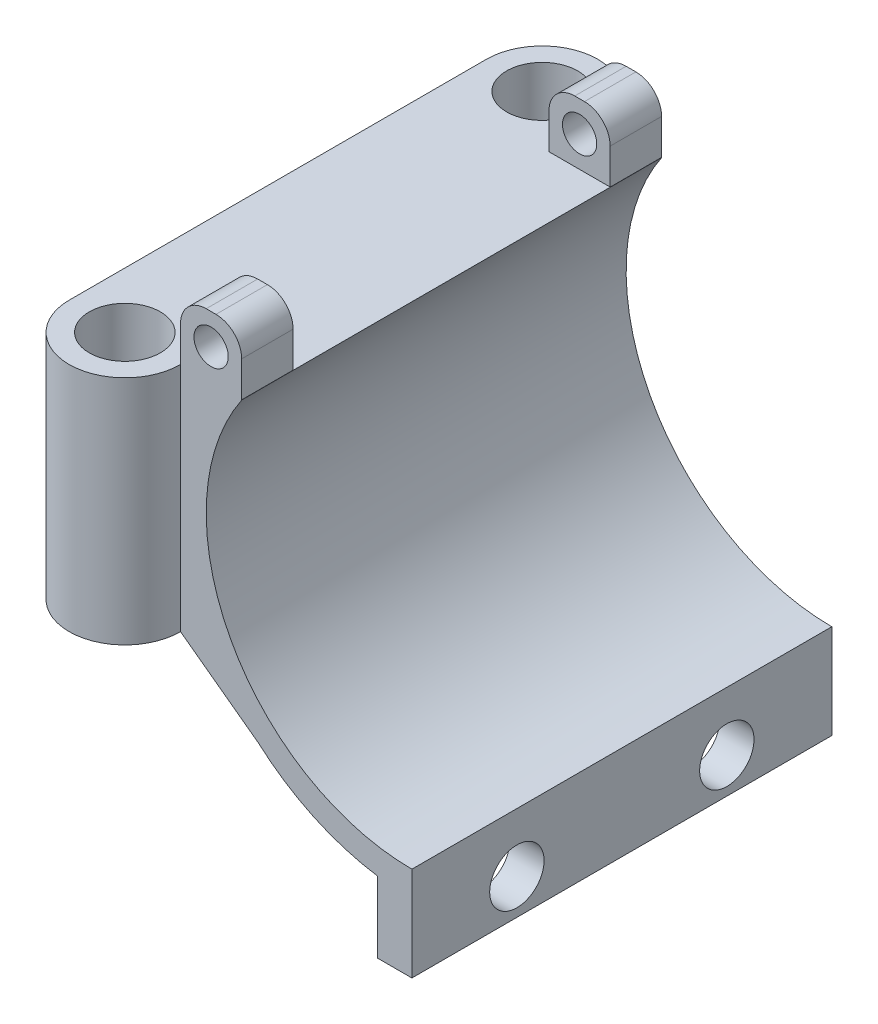
ISO-10303-21;
HEADER;
FILE_DESCRIPTION(('STEP AP214'),'2;1');
FILE_NAME('part.step','',(''),(''),'','','');
FILE_SCHEMA(('AUTOMOTIVE_DESIGN { 1 0 10303 214 1 1 1 1 }'));
ENDSEC;
DATA;
#1=APPLICATION_CONTEXT('core data for automotive mechanical design processes');
#2=APPLICATION_PROTOCOL_DEFINITION('international standard','automotive_design',2000,#1);
#3=PRODUCT_CONTEXT('',#1,'mechanical');
#4=PRODUCT('Part','Part','',(#3));
#5=PRODUCT_RELATED_PRODUCT_CATEGORY('part','',(#4));
#6=PRODUCT_DEFINITION_FORMATION('','',#4);
#7=PRODUCT_DEFINITION_CONTEXT('part definition',#1,'design');
#8=PRODUCT_DEFINITION('design','',#6,#7);
#9=PRODUCT_DEFINITION_SHAPE('','',#8);
#10=(LENGTH_UNIT() NAMED_UNIT(*) SI_UNIT(.MILLI.,.METRE.));
#11=(NAMED_UNIT(*) PLANE_ANGLE_UNIT() SI_UNIT($,.RADIAN.));
#12=(NAMED_UNIT(*) SI_UNIT($,.STERADIAN.) SOLID_ANGLE_UNIT());
#13=UNCERTAINTY_MEASURE_WITH_UNIT(LENGTH_MEASURE(1.E-05),#10,'distance_accuracy_value','');
#14=(GEOMETRIC_REPRESENTATION_CONTEXT(3) GLOBAL_UNCERTAINTY_ASSIGNED_CONTEXT((#13)) GLOBAL_UNIT_ASSIGNED_CONTEXT((#10,
#11,#12)) REPRESENTATION_CONTEXT('',''));
#15=CARTESIAN_POINT('',(0.,0.,0.));
#16=DIRECTION('',(0.,0.,1.));
#17=DIRECTION('',(1.,0.,0.));
#18=AXIS2_PLACEMENT_3D('',#15,#16,#17);
#19=CARTESIAN_POINT('',(6.5,27.,-49.));
#20=DIRECTION('',(-1.,0.,0.));
#21=DIRECTION('',(0.,0.,1.));
#22=AXIS2_PLACEMENT_3D('',#19,#20,#21);
#23=PLANE('',#22);
#24=DIRECTION('',(0.,1.,0.));
#25=VECTOR('',#24,1.);
#26=CARTESIAN_POINT('',(6.5,-10.6858158863364,-43.));
#27=LINE('',#26,#25);
#28=CARTESIAN_POINT('',(6.5,27.,-43.));
#29=VERTEX_POINT('',#28);
#30=CARTESIAN_POINT('',(6.5,31.1392792268898,-43.));
#31=VERTEX_POINT('',#30);
#32=EDGE_CURVE('E216',#29,#31,#27,.T.);
#33=ORIENTED_EDGE('',*,*,#32,.T.);
#34=DIRECTION('',(0.,0.,1.));
#35=VECTOR('',#34,1.);
#36=CARTESIAN_POINT('',(6.5,31.1392792268898,-49.));
#37=LINE('',#36,#35);
#38=CARTESIAN_POINT('',(6.5,31.1392792268898,-49.));
#39=VERTEX_POINT('',#38);
#40=EDGE_CURVE('E356',#31,#39,#37,.F.);
#41=ORIENTED_EDGE('',*,*,#40,.T.);
#42=DIRECTION('',(0.,-1.,0.));
#43=VECTOR('',#42,1.);
#44=CARTESIAN_POINT('',(6.5,27.,-49.));
#45=LINE('',#44,#43);
#46=CARTESIAN_POINT('',(6.5,0.,-49.));
#47=VERTEX_POINT('',#46);
#48=EDGE_CURVE('E271',#39,#47,#45,.T.);
#49=ORIENTED_EDGE('',*,*,#48,.T.);
#50=DIRECTION('',(0.,0.,1.));
#51=VECTOR('',#50,1.);
#52=CARTESIAN_POINT('',(6.5,0.,-49.));
#53=LINE('',#52,#51);
#54=CARTESIAN_POINT('',(6.5,0.,-48.7));
#55=VERTEX_POINT('',#54);
#56=EDGE_CURVE('E280',#47,#55,#53,.T.);
#57=ORIENTED_EDGE('',*,*,#56,.T.);
#58=DIRECTION('',(0.,-1.,0.));
#59=VECTOR('',#58,1.);
#60=CARTESIAN_POINT('',(6.5,27.,-48.7));
#61=LINE('',#60,#59);
#62=CARTESIAN_POINT('',(6.5,27.,-48.7));
#63=VERTEX_POINT('',#62);
#64=EDGE_CURVE('E316',#63,#55,#61,.T.);
#65=ORIENTED_EDGE('',*,*,#64,.F.);
#66=DIRECTION('',(0.,0.,1.));
#67=VECTOR('',#66,1.);
#68=CARTESIAN_POINT('',(6.5,27.,-59.0950125563574));
#69=LINE('',#68,#67);
#70=EDGE_CURVE('E265',#63,#29,#69,.T.);
#71=ORIENTED_EDGE('',*,*,#70,.T.);
#72=EDGE_LOOP('',(#33,#41,#49,#57,#65,#71));
#73=FACE_BOUND('',#72,.T.);
#74=ADVANCED_FACE('F33',(#73),#23,.T.);
#75=CARTESIAN_POINT('',(6.5,34.1392792268898,-59.0950125563574));
#76=DIRECTION('',(0.,1.,0.));
#77=DIRECTION('',(0.,0.,1.));
#78=AXIS2_PLACEMENT_3D('',#75,#76,#77);
#79=PLANE('',#78);
#80=DIRECTION('',(-1.,0.,0.));
#81=VECTOR('',#80,1.);
#82=CARTESIAN_POINT('',(6.5,34.1392792268898,-43.));
#83=LINE('',#82,#81);
#84=CARTESIAN_POINT('',(10.6372242947461,34.1392792268898,-43.));
#85=VERTEX_POINT('',#84);
#86=CARTESIAN_POINT('',(9.5,34.1392792268898,-43.));
#87=VERTEX_POINT('',#86);
#88=EDGE_CURVE('E218',#85,#87,#83,.T.);
#89=ORIENTED_EDGE('',*,*,#88,.F.);
#90=DIRECTION('',(0.,0.,1.));
#91=VECTOR('',#90,1.);
#92=CARTESIAN_POINT('',(10.6372242947461,34.1392792268898,-59.0950125563574));
#93=LINE('',#92,#91);
#94=CARTESIAN_POINT('',(10.6372242947461,34.1392792268898,-49.));
#95=VERTEX_POINT('',#94);
#96=EDGE_CURVE('E348',#85,#95,#93,.F.);
#97=ORIENTED_EDGE('',*,*,#96,.T.);
#98=DIRECTION('',(1.,0.,0.));
#99=VECTOR('',#98,1.);
#100=CARTESIAN_POINT('',(6.5,34.1392792268898,-49.));
#101=LINE('',#100,#99);
#102=CARTESIAN_POINT('',(9.5,34.1392792268898,-49.));
#103=VERTEX_POINT('',#102);
#104=EDGE_CURVE('E248',#103,#95,#101,.T.);
#105=ORIENTED_EDGE('',*,*,#104,.F.);
#106=DIRECTION('',(0.,0.,1.));
#107=VECTOR('',#106,1.);
#108=CARTESIAN_POINT('',(9.5,34.1392792268898,-59.0950125563574));
#109=LINE('',#108,#107);
#110=EDGE_CURVE('E345',#103,#87,#109,.T.);
#111=ORIENTED_EDGE('',*,*,#110,.T.);
#112=EDGE_LOOP('',(#89,#97,#105,#111));
#113=FACE_BOUND('',#112,.T.);
#114=ADVANCED_FACE('F382',(#113),#79,.T.);
#115=CARTESIAN_POINT('',(13.6372242947461,27.,-59.0950125563574));
#116=DIRECTION('',(1.,0.,0.));
#117=DIRECTION('',(0.,0.,-1.));
#118=AXIS2_PLACEMENT_3D('',#115,#116,#117);
#119=PLANE('',#118);
#120=DIRECTION('',(0.,1.,0.));
#121=VECTOR('',#120,1.);
#122=CARTESIAN_POINT('',(13.6372242947461,27.,-43.));
#123=LINE('',#122,#121);
#124=CARTESIAN_POINT('',(13.6372242947461,27.,-43.));
#125=VERTEX_POINT('',#124);
#126=CARTESIAN_POINT('',(13.6372242947461,31.1392792268898,-43.));
#127=VERTEX_POINT('',#126);
#128=EDGE_CURVE('E234',#125,#127,#123,.T.);
#129=ORIENTED_EDGE('',*,*,#128,.F.);
#130=DIRECTION('',(0.,0.,1.));
#131=VECTOR('',#130,1.);
#132=CARTESIAN_POINT('',(13.6372242947461,27.,-59.0950125563574));
#133=LINE('',#132,#131);
#134=CARTESIAN_POINT('',(13.6372242947461,27.,-49.));
#135=VERTEX_POINT('',#134);
#136=EDGE_CURVE('E249',#135,#125,#133,.T.);
#137=ORIENTED_EDGE('',*,*,#136,.F.);
#138=DIRECTION('',(0.,-1.,0.));
#139=VECTOR('',#138,1.);
#140=CARTESIAN_POINT('',(13.6372242947461,27.,-49.));
#141=LINE('',#140,#139);
#142=CARTESIAN_POINT('',(13.6372242947461,31.1392792268898,-49.));
#143=VERTEX_POINT('',#142);
#144=EDGE_CURVE('E246',#143,#135,#141,.T.);
#145=ORIENTED_EDGE('',*,*,#144,.F.);
#146=DIRECTION('',(0.,0.,1.));
#147=VECTOR('',#146,1.);
#148=CARTESIAN_POINT('',(13.6372242947461,31.1392792268898,-59.0950125563574));
#149=LINE('',#148,#147);
#150=EDGE_CURVE('E337',#143,#127,#149,.T.);
#151=ORIENTED_EDGE('',*,*,#150,.T.);
#152=EDGE_LOOP('',(#129,#137,#145,#151));
#153=FACE_BOUND('',#152,.T.);
#154=ADVANCED_FACE('F393',(#153),#119,.T.);
#155=CARTESIAN_POINT('',(10.068612147373,30.5696396134449,-51.));
#156=DIRECTION('',(0.,0.,1.));
#157=DIRECTION('',(1.,0.,0.));
#158=AXIS2_PLACEMENT_3D('',#155,#156,#157);
#159=CYLINDRICAL_SURFACE('',#158,2.);
#160=CARTESIAN_POINT('',(10.068612147373,30.5696396134449,-43.));
#161=DIRECTION('',(0.,0.,-1.));
#162=DIRECTION('',(-1.,0.,0.));
#163=AXIS2_PLACEMENT_3D('',#160,#161,#162);
#164=CIRCLE('',#163,2.);
#165=CARTESIAN_POINT('',(8.06861214737304,30.5696396134449,-43.));
#166=VERTEX_POINT('',#165);
#167=EDGE_CURVE('E236',#166,#166,#164,.F.);
#168=ORIENTED_EDGE('',*,*,#167,.T.);
#169=EDGE_LOOP('',(#168));
#170=FACE_BOUND('',#169,.T.);
#171=CARTESIAN_POINT('',(10.068612147373,30.5696396134449,-49.));
#172=DIRECTION('',(0.,0.,1.));
#173=DIRECTION('',(1.,0.,0.));
#174=AXIS2_PLACEMENT_3D('',#171,#172,#173);
#175=CIRCLE('',#174,2.);
#176=CARTESIAN_POINT('',(12.068612147373,30.5696396134449,-49.));
#177=VERTEX_POINT('',#176);
#178=EDGE_CURVE('E242',#177,#177,#175,.T.);
#179=ORIENTED_EDGE('',*,*,#178,.F.);
#180=EDGE_LOOP('',(#179));
#181=FACE_BOUND('',#180,.T.);
#182=ADVANCED_FACE('F495',(#170,#181),#159,.F.);
#183=CARTESIAN_POINT('',(10.6372242947461,31.1392792268898,-59.0950125563574));
#184=DIRECTION('',(0.,0.,1.));
#185=DIRECTION('',(1.,0.,0.));
#186=AXIS2_PLACEMENT_3D('',#183,#184,#185);
#187=CYLINDRICAL_SURFACE('',#186,3.);
#188=CARTESIAN_POINT('',(10.6372242947461,31.1392792268898,-43.));
#189=DIRECTION('',(0.,0.,-1.));
#190=DIRECTION('',(-1.,0.,0.));
#191=AXIS2_PLACEMENT_3D('',#188,#189,#190);
#192=CIRCLE('',#191,3.);
#193=EDGE_CURVE('E232',#127,#85,#192,.F.);
#194=ORIENTED_EDGE('',*,*,#193,.F.);
#195=ORIENTED_EDGE('',*,*,#150,.F.);
#196=CARTESIAN_POINT('',(10.6372242947461,31.1392792268898,-49.));
#197=DIRECTION('',(0.,0.,1.));
#198=DIRECTION('',(1.,0.,0.));
#199=AXIS2_PLACEMENT_3D('',#196,#197,#198);
#200=CIRCLE('',#199,3.);
#201=EDGE_CURVE('E354',#95,#143,#200,.F.);
#202=ORIENTED_EDGE('',*,*,#201,.F.);
#203=ORIENTED_EDGE('',*,*,#96,.F.);
#204=EDGE_LOOP('',(#194,#195,#202,#203));
#205=FACE_BOUND('',#204,.T.);
#206=ADVANCED_FACE('F386',(#205),#187,.T.);
#207=CARTESIAN_POINT('',(9.5,31.1392792268898,-59.0950125563574));
#208=DIRECTION('',(0.,0.,1.));
#209=DIRECTION('',(1.,0.,0.));
#210=AXIS2_PLACEMENT_3D('',#207,#208,#209);
#211=CYLINDRICAL_SURFACE('',#210,3.);
#212=CARTESIAN_POINT('',(9.5,31.1392792268898,-43.));
#213=DIRECTION('',(0.,0.,-1.));
#214=DIRECTION('',(-1.,0.,0.));
#215=AXIS2_PLACEMENT_3D('',#212,#213,#214);
#216=CIRCLE('',#215,3.);
#217=EDGE_CURVE('E41',#87,#31,#216,.F.);
#218=ORIENTED_EDGE('',*,*,#217,.F.);
#219=ORIENTED_EDGE('',*,*,#110,.F.);
#220=CARTESIAN_POINT('',(9.5,31.1392792268898,-49.));
#221=DIRECTION('',(0.,0.,1.));
#222=DIRECTION('',(1.,0.,0.));
#223=AXIS2_PLACEMENT_3D('',#220,#221,#222);
#224=CIRCLE('',#223,3.);
#225=EDGE_CURVE('E352',#39,#103,#224,.F.);
#226=ORIENTED_EDGE('',*,*,#225,.F.);
#227=ORIENTED_EDGE('',*,*,#40,.F.);
#228=EDGE_LOOP('',(#218,#219,#226,#227));
#229=FACE_BOUND('',#228,.T.);
#230=ADVANCED_FACE('F374',(#229),#211,.T.);
#231=CARTESIAN_POINT('',(0.,27.,-48.7));
#232=DIRECTION('',(0.,1.,0.));
#233=DIRECTION('',(0.,0.,1.));
#234=AXIS2_PLACEMENT_3D('',#231,#232,#233);
#235=PLANE('',#234);
#236=DIRECTION('',(-1.,0.,0.));
#237=VECTOR('',#236,1.);
#238=CARTESIAN_POINT('',(6.5,27.,0.));
#239=LINE('',#238,#237);
#240=CARTESIAN_POINT('',(13.6568651670156,27.,0.));
#241=VERTEX_POINT('',#240);
#242=CARTESIAN_POINT('',(13.6372242947461,27.,0.));
#243=VERTEX_POINT('',#242);
#244=EDGE_CURVE('E252',#241,#243,#239,.T.);
#245=ORIENTED_EDGE('',*,*,#244,.F.);
#246=DIRECTION('',(0.,0.,1.));
#247=VECTOR('',#246,1.);
#248=CARTESIAN_POINT('',(13.6568651670156,27.,-49.));
#249=LINE('',#248,#247);
#250=CARTESIAN_POINT('',(13.6568651670156,27.,-49.));
#251=VERTEX_POINT('',#250);
#252=EDGE_CURVE('E287',#251,#241,#249,.T.);
#253=ORIENTED_EDGE('',*,*,#252,.F.);
#254=DIRECTION('',(-1.,0.,0.));
#255=VECTOR('',#254,1.);
#256=CARTESIAN_POINT('',(6.5,27.,-49.));
#257=LINE('',#256,#255);
#258=EDGE_CURVE('E268',#251,#135,#257,.T.);
#259=ORIENTED_EDGE('',*,*,#258,.T.);
#260=ORIENTED_EDGE('',*,*,#136,.T.);
#261=DIRECTION('',(1.,0.,0.));
#262=VECTOR('',#261,1.);
#263=CARTESIAN_POINT('',(6.5,27.,-43.));
#264=LINE('',#263,#262);
#265=EDGE_CURVE('E213',#29,#125,#264,.T.);
#266=ORIENTED_EDGE('',*,*,#265,.F.);
#267=ORIENTED_EDGE('',*,*,#70,.F.);
#268=CARTESIAN_POINT('',(0.,27.,-48.7));
#269=DIRECTION('',(0.,1.,0.));
#270=DIRECTION('',(0.,0.,1.));
#271=AXIS2_PLACEMENT_3D('',#268,#269,#270);
#272=CIRCLE('',#271,6.5);
#273=CARTESIAN_POINT('',(-6.5,27.,-48.7));
#274=VERTEX_POINT('',#273);
#275=EDGE_CURVE('E307',#63,#274,#272,.T.);
#276=ORIENTED_EDGE('',*,*,#275,.T.);
#277=DIRECTION('',(0.,0.,1.));
#278=VECTOR('',#277,1.);
#279=CARTESIAN_POINT('',(-6.5,27.,-48.7));
#280=LINE('',#279,#278);
#281=CARTESIAN_POINT('',(-6.5,27.,0.));
#282=VERTEX_POINT('',#281);
#283=EDGE_CURVE('E310',#274,#282,#280,.T.);
#284=ORIENTED_EDGE('',*,*,#283,.T.);
#285=CARTESIAN_POINT('',(0.,27.,0.));
#286=DIRECTION('',(0.,1.,0.));
#287=DIRECTION('',(0.,0.,1.));
#288=AXIS2_PLACEMENT_3D('',#285,#286,#287);
#289=CIRCLE('',#288,6.5);
#290=CARTESIAN_POINT('',(6.5,27.,0.));
#291=VERTEX_POINT('',#290);
#292=EDGE_CURVE('E313',#282,#291,#289,.T.);
#293=ORIENTED_EDGE('',*,*,#292,.T.);
#294=CARTESIAN_POINT('',(6.50000000000001,27.,-6.));
#295=VERTEX_POINT('',#294);
#296=EDGE_CURVE('E261',#295,#291,#69,.T.);
#297=ORIENTED_EDGE('',*,*,#296,.F.);
#298=DIRECTION('',(-1.,0.,0.));
#299=VECTOR('',#298,1.);
#300=CARTESIAN_POINT('',(6.50000000000001,27.,-6.));
#301=LINE('',#300,#299);
#302=CARTESIAN_POINT('',(13.6372242947461,27.,-6.));
#303=VERTEX_POINT('',#302);
#304=EDGE_CURVE('E215',#303,#295,#301,.T.);
#305=ORIENTED_EDGE('',*,*,#304,.F.);
#306=EDGE_CURVE('E264',#303,#243,#133,.T.);
#307=ORIENTED_EDGE('',*,*,#306,.T.);
#308=EDGE_LOOP('',(#245,#253,#259,#260,#266,#267,#276,#284,#293,#297,#305,#307));
#309=FACE_BOUND('',#308,.T.);
#310=CARTESIAN_POINT('',(0.,27.,0.));
#311=DIRECTION('',(0.,1.,0.));
#312=DIRECTION('',(0.,0.,1.));
#313=AXIS2_PLACEMENT_3D('',#310,#311,#312);
#314=CIRCLE('',#313,4.15);
#315=CARTESIAN_POINT('',(0.,27.,4.15));
#316=VERTEX_POINT('',#315);
#317=EDGE_CURVE('E301',#316,#316,#314,.T.);
#318=ORIENTED_EDGE('',*,*,#317,.F.);
#319=EDGE_LOOP('',(#318));
#320=FACE_BOUND('',#319,.T.);
#321=CARTESIAN_POINT('',(0.,27.,-48.7));
#322=DIRECTION('',(0.,1.,0.));
#323=DIRECTION('',(0.,0.,1.));
#324=AXIS2_PLACEMENT_3D('',#321,#322,#323);
#325=CIRCLE('',#324,4.15);
#326=CARTESIAN_POINT('',(0.,27.,-44.55));
#327=VERTEX_POINT('',#326);
#328=EDGE_CURVE('E295',#327,#327,#325,.T.);
#329=ORIENTED_EDGE('',*,*,#328,.F.);
#330=EDGE_LOOP('',(#329));
#331=FACE_BOUND('',#330,.T.);
#332=ADVANCED_FACE('F397',(#309,#320,#331),#235,.T.);
#333=CARTESIAN_POINT('',(0.,0.,-48.7));
#334=DIRECTION('',(0.,1.,0.));
#335=DIRECTION('',(0.,0.,1.));
#336=AXIS2_PLACEMENT_3D('',#333,#334,#335);
#337=PLANE('',#336);
#338=CARTESIAN_POINT('',(0.,0.,-48.7));
#339=DIRECTION('',(0.,1.,0.));
#340=DIRECTION('',(0.,0.,1.));
#341=AXIS2_PLACEMENT_3D('',#338,#339,#340);
#342=CIRCLE('',#341,6.5);
#343=CARTESIAN_POINT('',(-6.5,0.,-48.7));
#344=VERTEX_POINT('',#343);
#345=EDGE_CURVE('E304',#55,#344,#342,.T.);
#346=ORIENTED_EDGE('',*,*,#345,.F.);
#347=DIRECTION('',(0.,0.,-1.));
#348=VECTOR('',#347,1.);
#349=CARTESIAN_POINT('',(6.5,0.,-48.7));
#350=LINE('',#349,#348);
#351=CARTESIAN_POINT('',(6.5,0.,0.));
#352=VERTEX_POINT('',#351);
#353=EDGE_CURVE('E311',#352,#55,#350,.T.);
#354=ORIENTED_EDGE('',*,*,#353,.F.);
#355=CARTESIAN_POINT('',(0.,0.,0.));
#356=DIRECTION('',(0.,1.,0.));
#357=DIRECTION('',(0.,0.,1.));
#358=AXIS2_PLACEMENT_3D('',#355,#356,#357);
#359=CIRCLE('',#358,6.5);
#360=CARTESIAN_POINT('',(-6.5,0.,0.));
#361=VERTEX_POINT('',#360);
#362=EDGE_CURVE('E321',#361,#352,#359,.T.);
#363=ORIENTED_EDGE('',*,*,#362,.F.);
#364=DIRECTION('',(0.,0.,1.));
#365=VECTOR('',#364,1.);
#366=CARTESIAN_POINT('',(-6.5,0.,-48.7));
#367=LINE('',#366,#365);
#368=EDGE_CURVE('E319',#344,#361,#367,.T.);
#369=ORIENTED_EDGE('',*,*,#368,.F.);
#370=EDGE_LOOP('',(#346,#354,#363,#369));
#371=FACE_BOUND('',#370,.T.);
#372=CARTESIAN_POINT('',(0.,0.,0.));
#373=DIRECTION('',(0.,1.,0.));
#374=DIRECTION('',(0.,0.,1.));
#375=AXIS2_PLACEMENT_3D('',#372,#373,#374);
#376=CIRCLE('',#375,4.15);
#377=CARTESIAN_POINT('',(0.,0.,4.15));
#378=VERTEX_POINT('',#377);
#379=EDGE_CURVE('E298',#378,#378,#376,.T.);
#380=ORIENTED_EDGE('',*,*,#379,.T.);
#381=EDGE_LOOP('',(#380));
#382=FACE_BOUND('',#381,.T.);
#383=CARTESIAN_POINT('',(0.,0.,-48.7));
#384=DIRECTION('',(0.,1.,0.));
#385=DIRECTION('',(0.,0.,1.));
#386=AXIS2_PLACEMENT_3D('',#383,#384,#385);
#387=CIRCLE('',#386,4.15);
#388=CARTESIAN_POINT('',(0.,0.,-44.55));
#389=VERTEX_POINT('',#388);
#390=EDGE_CURVE('E290',#389,#389,#387,.T.);
#391=ORIENTED_EDGE('',*,*,#390,.T.);
#392=EDGE_LOOP('',(#391));
#393=FACE_BOUND('',#392,.T.);
#394=ADVANCED_FACE('F474',(#371,#382,#393),#337,.F.);
#395=CARTESIAN_POINT('',(0.,27.,-48.7));
#396=DIRECTION('',(0.,-1.,0.));
#397=DIRECTION('',(0.,0.,-1.));
#398=AXIS2_PLACEMENT_3D('',#395,#396,#397);
#399=CYLINDRICAL_SURFACE('',#398,6.5);
#400=ORIENTED_EDGE('',*,*,#345,.T.);
#401=DIRECTION('',(0.,-1.,0.));
#402=VECTOR('',#401,1.);
#403=CARTESIAN_POINT('',(-6.5,27.,-48.7));
#404=LINE('',#403,#402);
#405=EDGE_CURVE('E333',#274,#344,#404,.T.);
#406=ORIENTED_EDGE('',*,*,#405,.F.);
#407=ORIENTED_EDGE('',*,*,#275,.F.);
#408=ORIENTED_EDGE('',*,*,#64,.T.);
#409=EDGE_LOOP('',(#400,#406,#407,#408));
#410=FACE_BOUND('',#409,.T.);
#411=ADVANCED_FACE('F477',(#410),#399,.T.);
#412=CARTESIAN_POINT('',(-6.5,27.,-48.7));
#413=DIRECTION('',(1.,0.,0.));
#414=DIRECTION('',(0.,0.,-1.));
#415=AXIS2_PLACEMENT_3D('',#412,#413,#414);
#416=PLANE('',#415);
#417=ORIENTED_EDGE('',*,*,#368,.T.);
#418=DIRECTION('',(0.,-1.,0.));
#419=VECTOR('',#418,1.);
#420=CARTESIAN_POINT('',(-6.5,27.,0.));
#421=LINE('',#420,#419);
#422=EDGE_CURVE('E330',#282,#361,#421,.T.);
#423=ORIENTED_EDGE('',*,*,#422,.F.);
#424=ORIENTED_EDGE('',*,*,#283,.F.);
#425=ORIENTED_EDGE('',*,*,#405,.T.);
#426=EDGE_LOOP('',(#417,#423,#424,#425));
#427=FACE_BOUND('',#426,.T.);
#428=ADVANCED_FACE('F481',(#427),#416,.F.);
#429=CARTESIAN_POINT('',(0.,27.,0.));
#430=DIRECTION('',(0.,-1.,0.));
#431=DIRECTION('',(0.,0.,-1.));
#432=AXIS2_PLACEMENT_3D('',#429,#430,#431);
#433=CYLINDRICAL_SURFACE('',#432,6.5);
#434=ORIENTED_EDGE('',*,*,#362,.T.);
#435=DIRECTION('',(0.,-1.,0.));
#436=VECTOR('',#435,1.);
#437=CARTESIAN_POINT('',(6.5,27.,0.));
#438=LINE('',#437,#436);
#439=EDGE_CURVE('E327',#291,#352,#438,.T.);
#440=ORIENTED_EDGE('',*,*,#439,.F.);
#441=ORIENTED_EDGE('',*,*,#292,.F.);
#442=ORIENTED_EDGE('',*,*,#422,.T.);
#443=EDGE_LOOP('',(#434,#440,#441,#442));
#444=FACE_BOUND('',#443,.T.);
#445=ADVANCED_FACE('F436',(#444),#433,.T.);
#446=CARTESIAN_POINT('',(0.,27.,0.));
#447=DIRECTION('',(0.,-1.,0.));
#448=DIRECTION('',(0.,0.,-1.));
#449=AXIS2_PLACEMENT_3D('',#446,#447,#448);
#450=CYLINDRICAL_SURFACE('',#449,4.15);
#451=ORIENTED_EDGE('',*,*,#317,.T.);
#452=EDGE_LOOP('',(#451));
#453=FACE_BOUND('',#452,.T.);
#454=ORIENTED_EDGE('',*,*,#379,.F.);
#455=EDGE_LOOP('',(#454));
#456=FACE_BOUND('',#455,.T.);
#457=ADVANCED_FACE('F463',(#453,#456),#450,.F.);
#458=CARTESIAN_POINT('',(0.,27.,-48.7));
#459=DIRECTION('',(0.,-1.,0.));
#460=DIRECTION('',(0.,0.,-1.));
#461=AXIS2_PLACEMENT_3D('',#458,#459,#460);
#462=CYLINDRICAL_SURFACE('',#461,4.15);
#463=ORIENTED_EDGE('',*,*,#328,.T.);
#464=EDGE_LOOP('',(#463));
#465=FACE_BOUND('',#464,.T.);
#466=ORIENTED_EDGE('',*,*,#390,.F.);
#467=EDGE_LOOP('',(#466));
#468=FACE_BOUND('',#467,.T.);
#469=ADVANCED_FACE('F459',(#465,#468),#462,.F.);
#470=DIRECTION('',(0.,1.,0.));
#471=VECTOR('',#470,1.);
#472=CARTESIAN_POINT('',(6.50000000000001,-10.6858158863364,-6.));
#473=LINE('',#472,#471);
#474=CARTESIAN_POINT('',(6.5,31.1392792268898,-6.));
#475=VERTEX_POINT('',#474);
#476=EDGE_CURVE('E220',#295,#475,#473,.T.);
#477=ORIENTED_EDGE('',*,*,#476,.F.);
#478=ORIENTED_EDGE('',*,*,#296,.T.);
#479=DIRECTION('',(0.,-1.,0.));
#480=VECTOR('',#479,1.);
#481=CARTESIAN_POINT('',(6.5,27.,0.));
#482=LINE('',#481,#480);
#483=CARTESIAN_POINT('',(6.5,31.1392792268898,0.));
#484=VERTEX_POINT('',#483);
#485=EDGE_CURVE('E245',#484,#291,#482,.T.);
#486=ORIENTED_EDGE('',*,*,#485,.F.);
#487=EDGE_CURVE('E357',#484,#475,#37,.F.);
#488=ORIENTED_EDGE('',*,*,#487,.T.);
#489=EDGE_LOOP('',(#477,#478,#486,#488));
#490=FACE_BOUND('',#489,.T.);
#491=ADVANCED_FACE('F431',(#490),#23,.T.);
#492=CARTESIAN_POINT('',(33.5,13.5,-49.));
#493=DIRECTION('',(0.,0.,1.));
#494=DIRECTION('',(1.,0.,0.));
#495=AXIS2_PLACEMENT_3D('',#492,#493,#494);
#496=CYLINDRICAL_SURFACE('',#495,24.);
#497=DIRECTION('',(0.,0.,1.));
#498=VECTOR('',#497,1.);
#499=CARTESIAN_POINT('',(33.5000000000002,-10.5,-49.));
#500=LINE('',#499,#498);
#501=CARTESIAN_POINT('',(33.5000000000002,-10.5,-49.));
#502=VERTEX_POINT('',#501);
#503=CARTESIAN_POINT('',(33.5000000000002,-10.5,0.));
#504=VERTEX_POINT('',#503);
#505=EDGE_CURVE('E210',#502,#504,#500,.T.);
#506=ORIENTED_EDGE('',*,*,#505,.F.);
#507=CARTESIAN_POINT('',(33.5,13.5,-49.));
#508=DIRECTION('',(0.,0.,-1.));
#509=DIRECTION('',(1.,0.,0.));
#510=AXIS2_PLACEMENT_3D('',#507,#508,#509);
#511=CIRCLE('',#510,24.);
#512=EDGE_CURVE('E278',#502,#251,#511,.T.);
#513=ORIENTED_EDGE('',*,*,#512,.T.);
#514=ORIENTED_EDGE('',*,*,#252,.T.);
#515=CARTESIAN_POINT('',(33.5,13.5,0.));
#516=DIRECTION('',(0.,0.,-1.));
#517=DIRECTION('',(1.,0.,0.));
#518=AXIS2_PLACEMENT_3D('',#515,#516,#517);
#519=CIRCLE('',#518,24.);
#520=EDGE_CURVE('E272',#504,#241,#519,.T.);
#521=ORIENTED_EDGE('',*,*,#520,.F.);
#522=EDGE_LOOP('',(#506,#513,#514,#521));
#523=FACE_BOUND('',#522,.T.);
#524=ADVANCED_FACE('F402',(#523),#496,.F.);
#525=CARTESIAN_POINT('',(33.5,13.5,-49.));
#526=DIRECTION('',(0.,0.,1.));
#527=DIRECTION('',(1.,0.,0.));
#528=AXIS2_PLACEMENT_3D('',#525,#526,#527);
#529=CYLINDRICAL_SURFACE('',#528,27.);
#530=DIRECTION('',(0.,0.,1.));
#531=VECTOR('',#530,1.);
#532=CARTESIAN_POINT('',(29.5000000000002,-13.2020598456374,-49.));
#533=LINE('',#532,#531);
#534=CARTESIAN_POINT('',(29.5000000000002,-13.2020598456374,0.));
#535=VERTEX_POINT('',#534);
#536=CARTESIAN_POINT('',(29.5000000000002,-13.2020598456374,-49.));
#537=VERTEX_POINT('',#536);
#538=EDGE_CURVE('E52',#535,#537,#533,.F.);
#539=ORIENTED_EDGE('',*,*,#538,.F.);
#540=CARTESIAN_POINT('',(33.5,13.5,0.));
#541=DIRECTION('',(0.,0.,1.));
#542=DIRECTION('',(1.,0.,0.));
#543=AXIS2_PLACEMENT_3D('',#540,#541,#542);
#544=CIRCLE('',#543,27.);
#545=CARTESIAN_POINT('',(15.5685703472865,-6.68573334337369,0.));
#546=VERTEX_POINT('',#545);
#547=EDGE_CURVE('E185',#546,#535,#544,.T.);
#548=ORIENTED_EDGE('',*,*,#547,.F.);
#549=DIRECTION('',(0.,0.,1.));
#550=VECTOR('',#549,1.);
#551=CARTESIAN_POINT('',(15.5685703472865,-6.68573334337369,-49.));
#552=LINE('',#551,#550);
#553=CARTESIAN_POINT('',(15.5685703472865,-6.68573334337369,-49.));
#554=VERTEX_POINT('',#553);
#555=EDGE_CURVE('E291',#554,#546,#552,.T.);
#556=ORIENTED_EDGE('',*,*,#555,.F.);
#557=CARTESIAN_POINT('',(33.5,13.5,-49.));
#558=DIRECTION('',(0.,0.,1.));
#559=DIRECTION('',(1.,0.,0.));
#560=AXIS2_PLACEMENT_3D('',#557,#558,#559);
#561=CIRCLE('',#560,27.);
#562=EDGE_CURVE('E48',#554,#537,#561,.T.);
#563=ORIENTED_EDGE('',*,*,#562,.T.);
#564=EDGE_LOOP('',(#539,#548,#556,#563));
#565=FACE_BOUND('',#564,.T.);
#566=ADVANCED_FACE('F442',(#565),#529,.T.);
#567=CARTESIAN_POINT('',(6.5,0.,-49.));
#568=DIRECTION('',(-0.593407769040933,-0.804901993811583,0.));
#569=DIRECTION('',(0.804901993811584,-0.593407769040934,0.));
#570=AXIS2_PLACEMENT_3D('',#567,#568,#569);
#571=PLANE('',#570);
#572=DIRECTION('',(0.804901993811583,-0.593407769040933,0.));
#573=VECTOR('',#572,1.);
#574=CARTESIAN_POINT('',(6.5,0.,0.));
#575=LINE('',#574,#573);
#576=EDGE_CURVE('E283',#352,#546,#575,.T.);
#577=ORIENTED_EDGE('',*,*,#576,.F.);
#578=ORIENTED_EDGE('',*,*,#353,.T.);
#579=ORIENTED_EDGE('',*,*,#56,.F.);
#580=DIRECTION('',(0.804901993811583,-0.593407769040933,0.));
#581=VECTOR('',#580,1.);
#582=CARTESIAN_POINT('',(6.5,0.,-49.));
#583=LINE('',#582,#581);
#584=EDGE_CURVE('E274',#47,#554,#583,.T.);
#585=ORIENTED_EDGE('',*,*,#584,.T.);
#586=ORIENTED_EDGE('',*,*,#555,.T.);
#587=EDGE_LOOP('',(#577,#578,#579,#585,#586));
#588=FACE_BOUND('',#587,.T.);
#589=ADVANCED_FACE('F440',(#588),#571,.T.);
#590=CARTESIAN_POINT('',(33.5,13.5,-49.));
#591=DIRECTION('',(0.,0.,1.));
#592=DIRECTION('',(1.,0.,0.));
#593=AXIS2_PLACEMENT_3D('',#590,#591,#592);
#594=PLANE('',#593);
#595=DIRECTION('',(0.,-1.,0.));
#596=VECTOR('',#595,1.);
#597=CARTESIAN_POINT('',(33.5000000000002,13.5,-49.));
#598=LINE('',#597,#596);
#599=CARTESIAN_POINT('',(33.5000000000002,-21.5,-49.));
#600=VERTEX_POINT('',#599);
#601=EDGE_CURVE('E207',#502,#600,#598,.T.);
#602=ORIENTED_EDGE('',*,*,#601,.T.);
#603=DIRECTION('',(-1.,0.,0.));
#604=VECTOR('',#603,1.);
#605=CARTESIAN_POINT('',(33.5000000000002,-21.5,-49.));
#606=LINE('',#605,#604);
#607=CARTESIAN_POINT('',(29.5000000000003,-21.5,-49.));
#608=VERTEX_POINT('',#607);
#609=EDGE_CURVE('E208',#600,#608,#606,.T.);
#610=ORIENTED_EDGE('',*,*,#609,.T.);
#611=DIRECTION('',(0.,1.,0.));
#612=VECTOR('',#611,1.);
#613=CARTESIAN_POINT('',(29.5000000000002,-10.5,-49.));
#614=LINE('',#613,#612);
#615=EDGE_CURVE('E194',#608,#537,#614,.T.);
#616=ORIENTED_EDGE('',*,*,#615,.T.);
#617=ORIENTED_EDGE('',*,*,#562,.F.);
#618=ORIENTED_EDGE('',*,*,#584,.F.);
#619=ORIENTED_EDGE('',*,*,#48,.F.);
#620=ORIENTED_EDGE('',*,*,#225,.T.);
#621=ORIENTED_EDGE('',*,*,#104,.T.);
#622=ORIENTED_EDGE('',*,*,#201,.T.);
#623=ORIENTED_EDGE('',*,*,#144,.T.);
#624=ORIENTED_EDGE('',*,*,#258,.F.);
#625=ORIENTED_EDGE('',*,*,#512,.F.);
#626=EDGE_LOOP('',(#602,#610,#616,#617,#618,#619,#620,#621,#622,#623,#624,#625));
#627=FACE_BOUND('',#626,.T.);
#628=ORIENTED_EDGE('',*,*,#178,.T.);
#629=EDGE_LOOP('',(#628));
#630=FACE_BOUND('',#629,.T.);
#631=ADVANCED_FACE('F377',(#627,#630),#594,.F.);
#632=CARTESIAN_POINT('',(33.5,13.5,0.));
#633=DIRECTION('',(0.,0.,1.));
#634=DIRECTION('',(1.,0.,0.));
#635=AXIS2_PLACEMENT_3D('',#632,#633,#634);
#636=PLANE('',#635);
#637=ORIENTED_EDGE('',*,*,#547,.T.);
#638=DIRECTION('',(0.,-1.,0.));
#639=VECTOR('',#638,1.);
#640=CARTESIAN_POINT('',(29.5000000000002,-10.5,0.));
#641=LINE('',#640,#639);
#642=CARTESIAN_POINT('',(29.5000000000003,-21.5,0.));
#643=VERTEX_POINT('',#642);
#644=EDGE_CURVE('E177',#535,#643,#641,.T.);
#645=ORIENTED_EDGE('',*,*,#644,.T.);
#646=DIRECTION('',(1.,0.,0.));
#647=VECTOR('',#646,1.);
#648=CARTESIAN_POINT('',(33.5000000000002,-21.5,0.));
#649=LINE('',#648,#647);
#650=CARTESIAN_POINT('',(33.5000000000002,-21.5,0.));
#651=VERTEX_POINT('',#650);
#652=EDGE_CURVE('E183',#643,#651,#649,.T.);
#653=ORIENTED_EDGE('',*,*,#652,.T.);
#654=DIRECTION('',(0.,-1.,0.));
#655=VECTOR('',#654,1.);
#656=CARTESIAN_POINT('',(33.5000000000002,13.5,0.));
#657=LINE('',#656,#655);
#658=EDGE_CURVE('E11',#504,#651,#657,.T.);
#659=ORIENTED_EDGE('',*,*,#658,.F.);
#660=ORIENTED_EDGE('',*,*,#520,.T.);
#661=ORIENTED_EDGE('',*,*,#244,.T.);
#662=DIRECTION('',(0.,1.,0.));
#663=VECTOR('',#662,1.);
#664=CARTESIAN_POINT('',(13.6372242947461,27.,0.));
#665=LINE('',#664,#663);
#666=CARTESIAN_POINT('',(13.6372242947461,31.1392792268898,0.));
#667=VERTEX_POINT('',#666);
#668=EDGE_CURVE('E255',#243,#667,#665,.T.);
#669=ORIENTED_EDGE('',*,*,#668,.T.);
#670=CARTESIAN_POINT('',(10.6372242947461,31.1392792268898,0.));
#671=DIRECTION('',(0.,0.,1.));
#672=DIRECTION('',(1.,0.,0.));
#673=AXIS2_PLACEMENT_3D('',#670,#671,#672);
#674=CIRCLE('',#673,3.);
#675=CARTESIAN_POINT('',(10.6372242947461,34.1392792268898,0.));
#676=VERTEX_POINT('',#675);
#677=EDGE_CURVE('E342',#667,#676,#674,.T.);
#678=ORIENTED_EDGE('',*,*,#677,.T.);
#679=DIRECTION('',(-1.,0.,0.));
#680=VECTOR('',#679,1.);
#681=CARTESIAN_POINT('',(6.5,34.1392792268898,0.));
#682=LINE('',#681,#680);
#683=CARTESIAN_POINT('',(9.5,34.1392792268898,0.));
#684=VERTEX_POINT('',#683);
#685=EDGE_CURVE('E258',#676,#684,#682,.T.);
#686=ORIENTED_EDGE('',*,*,#685,.T.);
#687=CARTESIAN_POINT('',(9.5,31.1392792268898,0.));
#688=DIRECTION('',(0.,0.,1.));
#689=DIRECTION('',(1.,0.,0.));
#690=AXIS2_PLACEMENT_3D('',#687,#688,#689);
#691=CIRCLE('',#690,3.);
#692=EDGE_CURVE('E340',#684,#484,#691,.T.);
#693=ORIENTED_EDGE('',*,*,#692,.T.);
#694=ORIENTED_EDGE('',*,*,#485,.T.);
#695=ORIENTED_EDGE('',*,*,#439,.T.);
#696=ORIENTED_EDGE('',*,*,#576,.T.);
#697=EDGE_LOOP('',(#637,#645,#653,#659,#660,#661,#669,#678,#686,#693,#694,#695,#696));
#698=FACE_BOUND('',#697,.T.);
#699=CARTESIAN_POINT('',(10.068612147373,30.5696396134449,0.));
#700=DIRECTION('',(0.,0.,1.));
#701=DIRECTION('',(1.,0.,0.));
#702=AXIS2_PLACEMENT_3D('',#699,#700,#701);
#703=CIRCLE('',#702,2.);
#704=CARTESIAN_POINT('',(12.068612147373,30.5696396134449,0.));
#705=VERTEX_POINT('',#704);
#706=EDGE_CURVE('E239',#705,#705,#703,.T.);
#707=ORIENTED_EDGE('',*,*,#706,.F.);
#708=EDGE_LOOP('',(#707));
#709=FACE_BOUND('',#708,.T.);
#710=ADVANCED_FACE('F179',(#698,#709),#636,.T.);
#711=DIRECTION('',(1.,0.,0.));
#712=VECTOR('',#711,1.);
#713=CARTESIAN_POINT('',(6.50000000000001,34.1392792268898,-6.));
#714=LINE('',#713,#712);
#715=CARTESIAN_POINT('',(9.5,34.1392792268898,-6.));
#716=VERTEX_POINT('',#715);
#717=CARTESIAN_POINT('',(10.6372242947461,34.1392792268898,-6.));
#718=VERTEX_POINT('',#717);
#719=EDGE_CURVE('E212',#716,#718,#714,.T.);
#720=ORIENTED_EDGE('',*,*,#719,.F.);
#721=EDGE_CURVE('E344',#716,#684,#109,.T.);
#722=ORIENTED_EDGE('',*,*,#721,.T.);
#723=ORIENTED_EDGE('',*,*,#685,.F.);
#724=EDGE_CURVE('E349',#676,#718,#93,.F.);
#725=ORIENTED_EDGE('',*,*,#724,.T.);
#726=EDGE_LOOP('',(#720,#722,#723,#725));
#727=FACE_BOUND('',#726,.T.);
#728=ADVANCED_FACE('F422',(#727),#79,.T.);
#729=DIRECTION('',(0.,-1.,0.));
#730=VECTOR('',#729,1.);
#731=CARTESIAN_POINT('',(13.6372242947461,27.,-6.));
#732=LINE('',#731,#730);
#733=CARTESIAN_POINT('',(13.6372242947461,31.1392792268898,-6.));
#734=VERTEX_POINT('',#733);
#735=EDGE_CURVE('E227',#734,#303,#732,.T.);
#736=ORIENTED_EDGE('',*,*,#735,.F.);
#737=EDGE_CURVE('E336',#734,#667,#149,.T.);
#738=ORIENTED_EDGE('',*,*,#737,.T.);
#739=ORIENTED_EDGE('',*,*,#668,.F.);
#740=ORIENTED_EDGE('',*,*,#306,.F.);
#741=EDGE_LOOP('',(#736,#738,#739,#740));
#742=FACE_BOUND('',#741,.T.);
#743=ADVANCED_FACE('F412',(#742),#119,.T.);
#744=CARTESIAN_POINT('',(10.068612147373,30.5696396134449,-6.));
#745=DIRECTION('',(0.,0.,1.));
#746=DIRECTION('',(1.,0.,0.));
#747=AXIS2_PLACEMENT_3D('',#744,#745,#746);
#748=CIRCLE('',#747,2.);
#749=CARTESIAN_POINT('',(12.068612147373,30.5696396134449,-6.));
#750=VERTEX_POINT('',#749);
#751=EDGE_CURVE('E229',#750,#750,#748,.F.);
#752=ORIENTED_EDGE('',*,*,#751,.T.);
#753=EDGE_LOOP('',(#752));
#754=FACE_BOUND('',#753,.T.);
#755=ORIENTED_EDGE('',*,*,#706,.T.);
#756=EDGE_LOOP('',(#755));
#757=FACE_BOUND('',#756,.T.);
#758=ADVANCED_FACE('F488',(#754,#757),#159,.F.);
#759=CARTESIAN_POINT('',(10.6372242947461,31.1392792268898,-6.));
#760=DIRECTION('',(0.,0.,1.));
#761=DIRECTION('',(1.,0.,0.));
#762=AXIS2_PLACEMENT_3D('',#759,#760,#761);
#763=CIRCLE('',#762,3.);
#764=EDGE_CURVE('E225',#718,#734,#763,.F.);
#765=ORIENTED_EDGE('',*,*,#764,.F.);
#766=ORIENTED_EDGE('',*,*,#724,.F.);
#767=ORIENTED_EDGE('',*,*,#677,.F.);
#768=ORIENTED_EDGE('',*,*,#737,.F.);
#769=EDGE_LOOP('',(#765,#766,#767,#768));
#770=FACE_BOUND('',#769,.T.);
#771=ADVANCED_FACE('F418',(#770),#187,.T.);
#772=CARTESIAN_POINT('',(9.5,31.1392792268898,-6.));
#773=DIRECTION('',(0.,0.,1.));
#774=DIRECTION('',(1.,0.,0.));
#775=AXIS2_PLACEMENT_3D('',#772,#773,#774);
#776=CIRCLE('',#775,3.);
#777=EDGE_CURVE('E360',#475,#716,#776,.F.);
#778=ORIENTED_EDGE('',*,*,#777,.F.);
#779=ORIENTED_EDGE('',*,*,#487,.F.);
#780=ORIENTED_EDGE('',*,*,#692,.F.);
#781=ORIENTED_EDGE('',*,*,#721,.F.);
#782=EDGE_LOOP('',(#778,#779,#780,#781));
#783=FACE_BOUND('',#782,.T.);
#784=ADVANCED_FACE('F35',(#783),#211,.T.);
#785=CARTESIAN_POINT('',(6.5,-10.6858158863364,-43.));
#786=DIRECTION('',(0.,0.,-1.));
#787=DIRECTION('',(-1.,0.,0.));
#788=AXIS2_PLACEMENT_3D('',#785,#786,#787);
#789=PLANE('',#788);
#790=ORIENTED_EDGE('',*,*,#128,.T.);
#791=ORIENTED_EDGE('',*,*,#193,.T.);
#792=ORIENTED_EDGE('',*,*,#88,.T.);
#793=ORIENTED_EDGE('',*,*,#217,.T.);
#794=ORIENTED_EDGE('',*,*,#32,.F.);
#795=ORIENTED_EDGE('',*,*,#265,.T.);
#796=EDGE_LOOP('',(#790,#791,#792,#793,#794,#795));
#797=FACE_BOUND('',#796,.T.);
#798=ORIENTED_EDGE('',*,*,#167,.F.);
#799=EDGE_LOOP('',(#798));
#800=FACE_BOUND('',#799,.T.);
#801=ADVANCED_FACE('F364',(#797,#800),#789,.F.);
#802=CARTESIAN_POINT('',(6.50000000000001,-10.6858158863364,-6.));
#803=DIRECTION('',(0.,0.,1.));
#804=DIRECTION('',(1.,0.,0.));
#805=AXIS2_PLACEMENT_3D('',#802,#803,#804);
#806=PLANE('',#805);
#807=ORIENTED_EDGE('',*,*,#735,.T.);
#808=ORIENTED_EDGE('',*,*,#304,.T.);
#809=ORIENTED_EDGE('',*,*,#476,.T.);
#810=ORIENTED_EDGE('',*,*,#777,.T.);
#811=ORIENTED_EDGE('',*,*,#719,.T.);
#812=ORIENTED_EDGE('',*,*,#764,.T.);
#813=EDGE_LOOP('',(#807,#808,#809,#810,#811,#812));
#814=FACE_BOUND('',#813,.T.);
#815=ORIENTED_EDGE('',*,*,#751,.F.);
#816=EDGE_LOOP('',(#815));
#817=FACE_BOUND('',#816,.T.);
#818=ADVANCED_FACE('F508',(#814,#817),#806,.F.);
#819=CARTESIAN_POINT('',(33.5000000000002,-20.3769086703937,-51.));
#820=DIRECTION('',(-1.,0.,0.));
#821=DIRECTION('',(0.,0.,1.));
#822=AXIS2_PLACEMENT_3D('',#819,#820,#821);
#823=PLANE('',#822);
#824=CARTESIAN_POINT('',(33.5000000000002,-17.3510299228187,-36.75));
#825=DIRECTION('',(-1.,0.,0.));
#826=DIRECTION('',(0.,0.,1.));
#827=AXIS2_PLACEMENT_3D('',#824,#825,#826);
#828=CIRCLE('',#827,3.175);
#829=CARTESIAN_POINT('',(33.5000000000002,-17.3510299228187,-33.575));
#830=VERTEX_POINT('',#829);
#831=EDGE_CURVE('E187',#830,#830,#828,.T.);
#832=ORIENTED_EDGE('',*,*,#831,.T.);
#833=EDGE_LOOP('',(#832));
#834=FACE_BOUND('',#833,.T.);
#835=CARTESIAN_POINT('',(33.5000000000002,-17.3510299228187,-12.25));
#836=DIRECTION('',(-1.,0.,0.));
#837=DIRECTION('',(0.,0.,1.));
#838=AXIS2_PLACEMENT_3D('',#835,#836,#837);
#839=CIRCLE('',#838,3.175);
#840=CARTESIAN_POINT('',(33.5000000000002,-17.3510299228187,-9.075));
#841=VERTEX_POINT('',#840);
#842=EDGE_CURVE('E645',#841,#841,#839,.T.);
#843=ORIENTED_EDGE('',*,*,#842,.T.);
#844=EDGE_LOOP('',(#843));
#845=FACE_BOUND('',#844,.T.);
#846=ORIENTED_EDGE('',*,*,#505,.T.);
#847=ORIENTED_EDGE('',*,*,#658,.T.);
#848=DIRECTION('',(0.,0.,1.));
#849=VECTOR('',#848,1.);
#850=CARTESIAN_POINT('',(33.5000000000002,-21.5,-60.7046999107196));
#851=LINE('',#850,#849);
#852=EDGE_CURVE('E197',#600,#651,#851,.T.);
#853=ORIENTED_EDGE('',*,*,#852,.F.);
#854=ORIENTED_EDGE('',*,*,#601,.F.);
#855=EDGE_LOOP('',(#846,#847,#853,#854));
#856=FACE_BOUND('',#855,.T.);
#857=ADVANCED_FACE('F405',(#834,#845,#856),#823,.F.);
#858=CARTESIAN_POINT('',(33.5000000000002,-21.5,-60.7046999107196));
#859=DIRECTION('',(0.,-1.,0.));
#860=DIRECTION('',(0.,0.,-1.));
#861=AXIS2_PLACEMENT_3D('',#858,#859,#860);
#862=PLANE('',#861);
#863=ORIENTED_EDGE('',*,*,#609,.F.);
#864=ORIENTED_EDGE('',*,*,#852,.T.);
#865=ORIENTED_EDGE('',*,*,#652,.F.);
#866=DIRECTION('',(0.,0.,1.));
#867=VECTOR('',#866,1.);
#868=CARTESIAN_POINT('',(29.5000000000003,-21.5,-60.7046999107196));
#869=LINE('',#868,#867);
#870=EDGE_CURVE('E191',#608,#643,#869,.T.);
#871=ORIENTED_EDGE('',*,*,#870,.F.);
#872=EDGE_LOOP('',(#863,#864,#865,#871));
#873=FACE_BOUND('',#872,.T.);
#874=ADVANCED_FACE('F200',(#873),#862,.T.);
#875=CARTESIAN_POINT('',(29.5000000000002,-10.5,-60.7046999107196));
#876=DIRECTION('',(-1.,0.,0.));
#877=DIRECTION('',(0.,-1.,0.));
#878=AXIS2_PLACEMENT_3D('',#875,#876,#877);
#879=PLANE('',#878);
#880=CARTESIAN_POINT('',(29.5000000000003,-17.3510299228187,-36.75));
#881=DIRECTION('',(-1.,0.,0.));
#882=DIRECTION('',(0.,-1.,0.));
#883=AXIS2_PLACEMENT_3D('',#880,#881,#882);
#884=CIRCLE('',#883,3.175);
#885=CARTESIAN_POINT('',(29.5000000000003,-20.5260299228187,-36.75));
#886=VERTEX_POINT('',#885);
#887=EDGE_CURVE('E642',#886,#886,#884,.T.);
#888=ORIENTED_EDGE('',*,*,#887,.F.);
#889=EDGE_LOOP('',(#888));
#890=FACE_BOUND('',#889,.T.);
#891=CARTESIAN_POINT('',(29.5000000000003,-17.3510299228187,-12.25));
#892=DIRECTION('',(-1.,0.,0.));
#893=DIRECTION('',(0.,-1.,0.));
#894=AXIS2_PLACEMENT_3D('',#891,#892,#893);
#895=CIRCLE('',#894,3.175);
#896=CARTESIAN_POINT('',(29.5000000000003,-20.5260299228187,-12.25));
#897=VERTEX_POINT('',#896);
#898=EDGE_CURVE('E651',#897,#897,#895,.T.);
#899=ORIENTED_EDGE('',*,*,#898,.F.);
#900=EDGE_LOOP('',(#899));
#901=FACE_BOUND('',#900,.T.);
#902=ORIENTED_EDGE('',*,*,#644,.F.);
#903=ORIENTED_EDGE('',*,*,#538,.T.);
#904=ORIENTED_EDGE('',*,*,#615,.F.);
#905=ORIENTED_EDGE('',*,*,#870,.T.);
#906=EDGE_LOOP('',(#902,#903,#904,#905));
#907=FACE_BOUND('',#906,.T.);
#908=ADVANCED_FACE('F192',(#890,#901,#907),#879,.T.);
#909=CARTESIAN_POINT('',(78.5000000000003,-17.3510299228187,-12.25));
#910=DIRECTION('',(-1.,0.,0.));
#911=DIRECTION('',(0.,-1.,0.));
#912=AXIS2_PLACEMENT_3D('',#909,#910,#911);
#913=CYLINDRICAL_SURFACE('',#912,3.175);
#914=ORIENTED_EDGE('',*,*,#898,.T.);
#915=EDGE_LOOP('',(#914));
#916=FACE_BOUND('',#915,.T.);
#917=ORIENTED_EDGE('',*,*,#842,.F.);
#918=EDGE_LOOP('',(#917));
#919=FACE_BOUND('',#918,.T.);
#920=ADVANCED_FACE('F614',(#916,#919),#913,.F.);
#921=CARTESIAN_POINT('',(78.5000000000003,-17.3510299228187,-36.75));
#922=DIRECTION('',(-1.,0.,0.));
#923=DIRECTION('',(0.,-1.,0.));
#924=AXIS2_PLACEMENT_3D('',#921,#922,#923);
#925=CYLINDRICAL_SURFACE('',#924,3.175);
#926=ORIENTED_EDGE('',*,*,#887,.T.);
#927=EDGE_LOOP('',(#926));
#928=FACE_BOUND('',#927,.T.);
#929=ORIENTED_EDGE('',*,*,#831,.F.);
#930=EDGE_LOOP('',(#929));
#931=FACE_BOUND('',#930,.T.);
#932=ADVANCED_FACE('F623',(#928,#931),#925,.F.);
#933=CLOSED_SHELL('',(#74,#114,#154,#182,#206,#230,#332,#394,#411,#428,#445,#457,#469,#491,#524,
#566,#589,#631,#710,#728,#743,#758,#771,#784,#801,#818,#857,#874,#908,#920,#932));
#934=MANIFOLD_SOLID_BREP('B2',#933);
#935=ADVANCED_BREP_SHAPE_REPRESENTATION('',(#18,#934),#14);
#936=SHAPE_DEFINITION_REPRESENTATION(#9,#935);
ENDSEC;
END-ISO-10303-21;
